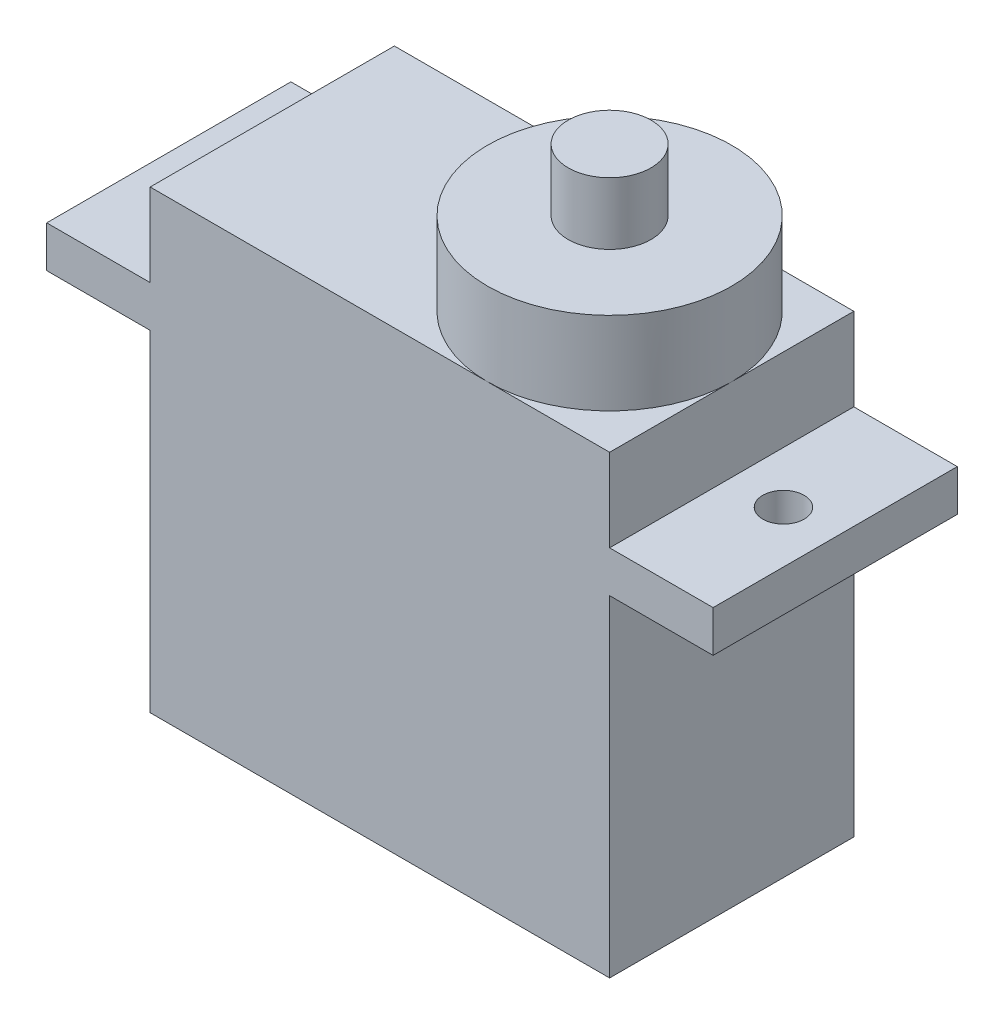
ISO-10303-21;
HEADER;
FILE_DESCRIPTION(('STEP AP214'),'2;1');
FILE_NAME('part.step','',(''),(''),'','','');
FILE_SCHEMA(('AUTOMOTIVE_DESIGN { 1 0 10303 214 1 1 1 1 }'));
ENDSEC;
DATA;
#1=APPLICATION_CONTEXT('core data for automotive mechanical design processes');
#2=APPLICATION_PROTOCOL_DEFINITION('international standard','automotive_design',2000,#1);
#3=PRODUCT_CONTEXT('',#1,'mechanical');
#4=PRODUCT('Part','Part','',(#3));
#5=PRODUCT_RELATED_PRODUCT_CATEGORY('part','',(#4));
#6=PRODUCT_DEFINITION_FORMATION('','',#4);
#7=PRODUCT_DEFINITION_CONTEXT('part definition',#1,'design');
#8=PRODUCT_DEFINITION('design','',#6,#7);
#9=PRODUCT_DEFINITION_SHAPE('','',#8);
#10=(LENGTH_UNIT() NAMED_UNIT(*) SI_UNIT(.MILLI.,.METRE.));
#11=(NAMED_UNIT(*) PLANE_ANGLE_UNIT() SI_UNIT($,.RADIAN.));
#12=(NAMED_UNIT(*) SI_UNIT($,.STERADIAN.) SOLID_ANGLE_UNIT());
#13=UNCERTAINTY_MEASURE_WITH_UNIT(LENGTH_MEASURE(1.E-05),#10,'distance_accuracy_value','');
#14=(GEOMETRIC_REPRESENTATION_CONTEXT(3) GLOBAL_UNCERTAINTY_ASSIGNED_CONTEXT((#13)) GLOBAL_UNIT_ASSIGNED_CONTEXT((#10,
#11,#12)) REPRESENTATION_CONTEXT('',''));
#15=CARTESIAN_POINT('',(0.,0.,0.));
#16=DIRECTION('',(0.,0.,1.));
#17=DIRECTION('',(1.,0.,0.));
#18=AXIS2_PLACEMENT_3D('',#15,#16,#17);
#19=CARTESIAN_POINT('',(-17.9964599489545,16.,11.8));
#20=DIRECTION('',(-1.,0.,0.));
#21=DIRECTION('',(0.,0.,1.));
#22=AXIS2_PLACEMENT_3D('',#19,#20,#21);
#23=PLANE('',#22);
#24=DIRECTION('',(0.,0.,-1.));
#25=VECTOR('',#24,1.);
#26=CARTESIAN_POINT('',(-17.9964599489545,0.,11.8));
#27=LINE('',#26,#25);
#28=CARTESIAN_POINT('',(-17.9964599489545,0.,11.8));
#29=VERTEX_POINT('',#28);
#30=CARTESIAN_POINT('',(-17.9964599489545,0.,0.));
#31=VERTEX_POINT('',#30);
#32=EDGE_CURVE('E241',#29,#31,#27,.T.);
#33=ORIENTED_EDGE('',*,*,#32,.T.);
#34=DIRECTION('',(0.,1.,0.));
#35=VECTOR('',#34,1.);
#36=CARTESIAN_POINT('',(-17.9964599489545,16.,0.));
#37=LINE('',#36,#35);
#38=CARTESIAN_POINT('',(-17.9964599489545,16.,0.));
#39=VERTEX_POINT('',#38);
#40=EDGE_CURVE('E204',#31,#39,#37,.T.);
#41=ORIENTED_EDGE('',*,*,#40,.T.);
#42=DIRECTION('',(0.,0.,-1.));
#43=VECTOR('',#42,1.);
#44=CARTESIAN_POINT('',(-17.9964599489545,16.,11.8));
#45=LINE('',#44,#43);
#46=CARTESIAN_POINT('',(-17.9964599489545,16.,11.8));
#47=VERTEX_POINT('',#46);
#48=EDGE_CURVE('E238',#47,#39,#45,.T.);
#49=ORIENTED_EDGE('',*,*,#48,.F.);
#50=DIRECTION('',(0.,1.,0.));
#51=VECTOR('',#50,1.);
#52=CARTESIAN_POINT('',(-17.9964599489545,16.,11.8));
#53=LINE('',#52,#51);
#54=EDGE_CURVE('E182',#29,#47,#53,.T.);
#55=ORIENTED_EDGE('',*,*,#54,.F.);
#56=EDGE_LOOP('',(#33,#41,#49,#55));
#57=FACE_BOUND('',#56,.T.);
#58=ADVANCED_FACE('F32',(#57),#23,.F.);
#59=CARTESIAN_POINT('',(-23.8964599489545,26.,5.9));
#60=DIRECTION('',(0.,1.,0.));
#61=DIRECTION('',(0.,0.,1.));
#62=AXIS2_PLACEMENT_3D('',#59,#60,#61);
#63=PLANE('',#62);
#64=CARTESIAN_POINT('',(-23.8964599489545,26.,5.9));
#65=DIRECTION('',(0.,1.,0.));
#66=DIRECTION('',(0.,0.,1.));
#67=AXIS2_PLACEMENT_3D('',#64,#65,#66);
#68=CIRCLE('',#67,5.9);
#69=CARTESIAN_POINT('',(-23.8964599489545,26.,11.8));
#70=VERTEX_POINT('',#69);
#71=EDGE_CURVE('E152',#70,#70,#68,.T.);
#72=ORIENTED_EDGE('',*,*,#71,.T.);
#73=EDGE_LOOP('',(#72));
#74=FACE_BOUND('',#73,.T.);
#75=CARTESIAN_POINT('',(-23.8964599489545,26.,5.9));
#76=DIRECTION('',(0.,1.,0.));
#77=DIRECTION('',(0.,0.,1.));
#78=AXIS2_PLACEMENT_3D('',#75,#76,#77);
#79=CIRCLE('',#78,2.);
#80=CARTESIAN_POINT('',(-23.8964599489545,26.,7.9));
#81=VERTEX_POINT('',#80);
#82=EDGE_CURVE('E495',#81,#81,#79,.T.);
#83=ORIENTED_EDGE('',*,*,#82,.F.);
#84=EDGE_LOOP('',(#83));
#85=FACE_BOUND('',#84,.T.);
#86=ADVANCED_FACE('F292',(#74,#85),#63,.T.);
#87=CARTESIAN_POINT('',(-40.1964599489545,22.,11.8));
#88=DIRECTION('',(0.,-1.,0.));
#89=DIRECTION('',(0.,0.,-1.));
#90=AXIS2_PLACEMENT_3D('',#87,#88,#89);
#91=PLANE('',#90);
#92=CARTESIAN_POINT('',(-23.8964599489545,22.,5.9));
#93=DIRECTION('',(0.,1.,0.));
#94=DIRECTION('',(0.,0.,1.));
#95=AXIS2_PLACEMENT_3D('',#92,#93,#94);
#96=CIRCLE('',#95,5.9);
#97=CARTESIAN_POINT('',(-23.8964599489545,22.,11.8));
#98=VERTEX_POINT('',#97);
#99=CARTESIAN_POINT('',(-17.9964599489545,22.,5.9));
#100=VERTEX_POINT('',#99);
#101=EDGE_CURVE('E43',#98,#100,#96,.T.);
#102=ORIENTED_EDGE('',*,*,#101,.F.);
#103=DIRECTION('',(-1.,0.,0.));
#104=VECTOR('',#103,1.);
#105=CARTESIAN_POINT('',(-40.1964599489545,22.,11.8));
#106=LINE('',#105,#104);
#107=CARTESIAN_POINT('',(-17.9964599489545,22.,11.8));
#108=VERTEX_POINT('',#107);
#109=EDGE_CURVE('E131',#108,#98,#106,.T.);
#110=ORIENTED_EDGE('',*,*,#109,.F.);
#111=DIRECTION('',(0.,0.,-1.));
#112=VECTOR('',#111,1.);
#113=CARTESIAN_POINT('',(-17.9964599489545,22.,11.8));
#114=LINE('',#113,#112);
#115=EDGE_CURVE('E150',#108,#100,#114,.T.);
#116=ORIENTED_EDGE('',*,*,#115,.T.);
#117=EDGE_LOOP('',(#102,#110,#116));
#118=FACE_BOUND('',#117,.T.);
#119=ADVANCED_FACE('F149',(#118),#91,.F.);
#120=CARTESIAN_POINT('',(-23.8964599489545,22.,0.));
#121=VERTEX_POINT('',#120);
#122=EDGE_CURVE('E11',#100,#121,#96,.T.);
#123=ORIENTED_EDGE('',*,*,#122,.F.);
#124=CARTESIAN_POINT('',(-17.9964599489545,22.,0.));
#125=VERTEX_POINT('',#124);
#126=EDGE_CURVE('E227',#100,#125,#114,.T.);
#127=ORIENTED_EDGE('',*,*,#126,.T.);
#128=DIRECTION('',(-1.,0.,0.));
#129=VECTOR('',#128,1.);
#130=CARTESIAN_POINT('',(-40.1964599489545,22.,0.));
#131=LINE('',#130,#129);
#132=EDGE_CURVE('E216',#125,#121,#131,.T.);
#133=ORIENTED_EDGE('',*,*,#132,.T.);
#134=EDGE_LOOP('',(#123,#127,#133));
#135=FACE_BOUND('',#134,.T.);
#136=ADVANCED_FACE('F424',(#135),#91,.F.);
#137=EDGE_CURVE('E41',#121,#98,#96,.T.);
#138=ORIENTED_EDGE('',*,*,#137,.F.);
#139=CARTESIAN_POINT('',(-40.1964599489545,22.,0.));
#140=VERTEX_POINT('',#139);
#141=EDGE_CURVE('E215',#121,#140,#131,.T.);
#142=ORIENTED_EDGE('',*,*,#141,.T.);
#143=DIRECTION('',(0.,0.,-1.));
#144=VECTOR('',#143,1.);
#145=CARTESIAN_POINT('',(-40.1964599489545,22.,11.8));
#146=LINE('',#145,#144);
#147=CARTESIAN_POINT('',(-40.1964599489545,22.,11.8));
#148=VERTEX_POINT('',#147);
#149=EDGE_CURVE('E146',#148,#140,#146,.T.);
#150=ORIENTED_EDGE('',*,*,#149,.F.);
#151=EDGE_CURVE('E134',#98,#148,#106,.T.);
#152=ORIENTED_EDGE('',*,*,#151,.F.);
#153=EDGE_LOOP('',(#138,#142,#150,#152));
#154=FACE_BOUND('',#153,.T.);
#155=ADVANCED_FACE('F144',(#154),#91,.F.);
#156=CARTESIAN_POINT('',(-45.1964599489545,16.,11.8));
#157=DIRECTION('',(1.,0.,0.));
#158=DIRECTION('',(0.,0.,-1.));
#159=AXIS2_PLACEMENT_3D('',#156,#157,#158);
#160=PLANE('',#159);
#161=DIRECTION('',(0.,-1.,0.));
#162=VECTOR('',#161,1.);
#163=CARTESIAN_POINT('',(-45.1964599489545,16.,0.));
#164=LINE('',#163,#162);
#165=CARTESIAN_POINT('',(-45.1964599489545,18.,0.));
#166=VERTEX_POINT('',#165);
#167=CARTESIAN_POINT('',(-45.1964599489545,16.,0.));
#168=VERTEX_POINT('',#167);
#169=EDGE_CURVE('E172',#166,#168,#164,.T.);
#170=ORIENTED_EDGE('',*,*,#169,.T.);
#171=DIRECTION('',(0.,0.,-1.));
#172=VECTOR('',#171,1.);
#173=CARTESIAN_POINT('',(-45.1964599489545,16.,11.8));
#174=LINE('',#173,#172);
#175=CARTESIAN_POINT('',(-45.1964599489545,16.,11.8));
#176=VERTEX_POINT('',#175);
#177=EDGE_CURVE('E36',#176,#168,#174,.T.);
#178=ORIENTED_EDGE('',*,*,#177,.F.);
#179=DIRECTION('',(0.,-1.,0.));
#180=VECTOR('',#179,1.);
#181=CARTESIAN_POINT('',(-45.1964599489545,16.,11.8));
#182=LINE('',#181,#180);
#183=CARTESIAN_POINT('',(-45.1964599489545,18.,11.8));
#184=VERTEX_POINT('',#183);
#185=EDGE_CURVE('E173',#184,#176,#182,.T.);
#186=ORIENTED_EDGE('',*,*,#185,.F.);
#187=DIRECTION('',(0.,0.,-1.));
#188=VECTOR('',#187,1.);
#189=CARTESIAN_POINT('',(-45.1964599489545,18.,11.8));
#190=LINE('',#189,#188);
#191=EDGE_CURVE('E194',#184,#166,#190,.T.);
#192=ORIENTED_EDGE('',*,*,#191,.T.);
#193=EDGE_LOOP('',(#170,#178,#186,#192));
#194=FACE_BOUND('',#193,.T.);
#195=ADVANCED_FACE('F34',(#194),#160,.F.);
#196=CARTESIAN_POINT('',(-40.1964599489545,16.,11.8));
#197=DIRECTION('',(0.,1.,0.));
#198=DIRECTION('',(-1.,0.,0.));
#199=AXIS2_PLACEMENT_3D('',#196,#197,#198);
#200=PLANE('',#199);
#201=CARTESIAN_POINT('',(-42.6964599489545,16.,5.9));
#202=DIRECTION('',(0.,1.,0.));
#203=DIRECTION('',(-1.,0.,0.));
#204=AXIS2_PLACEMENT_3D('',#201,#202,#203);
#205=CIRCLE('',#204,0.999999999999998);
#206=CARTESIAN_POINT('',(-43.6964599489545,16.,5.9));
#207=VERTEX_POINT('',#206);
#208=EDGE_CURVE('E169',#207,#207,#205,.T.);
#209=ORIENTED_EDGE('',*,*,#208,.T.);
#210=EDGE_LOOP('',(#209));
#211=FACE_BOUND('',#210,.T.);
#212=DIRECTION('',(1.,0.,0.));
#213=VECTOR('',#212,1.);
#214=CARTESIAN_POINT('',(-40.1964599489545,16.,0.));
#215=LINE('',#214,#213);
#216=CARTESIAN_POINT('',(-40.1964599489545,16.,0.));
#217=VERTEX_POINT('',#216);
#218=EDGE_CURVE('E197',#168,#217,#215,.T.);
#219=ORIENTED_EDGE('',*,*,#218,.T.);
#220=DIRECTION('',(0.,0.,-1.));
#221=VECTOR('',#220,1.);
#222=CARTESIAN_POINT('',(-40.1964599489545,16.,11.8));
#223=LINE('',#222,#221);
#224=CARTESIAN_POINT('',(-40.1964599489545,16.,11.8));
#225=VERTEX_POINT('',#224);
#226=EDGE_CURVE('E156',#225,#217,#223,.T.);
#227=ORIENTED_EDGE('',*,*,#226,.F.);
#228=DIRECTION('',(1.,0.,0.));
#229=VECTOR('',#228,1.);
#230=CARTESIAN_POINT('',(-40.1964599489545,16.,11.8));
#231=LINE('',#230,#229);
#232=EDGE_CURVE('E175',#176,#225,#231,.T.);
#233=ORIENTED_EDGE('',*,*,#232,.F.);
#234=ORIENTED_EDGE('',*,*,#177,.T.);
#235=EDGE_LOOP('',(#219,#227,#233,#234));
#236=FACE_BOUND('',#235,.T.);
#237=ADVANCED_FACE('F267',(#211,#236),#200,.F.);
#238=CARTESIAN_POINT('',(-40.1964599489545,0.,11.8));
#239=DIRECTION('',(1.,0.,0.));
#240=DIRECTION('',(0.,0.,-1.));
#241=AXIS2_PLACEMENT_3D('',#238,#239,#240);
#242=PLANE('',#241);
#243=DIRECTION('',(0.,-1.,0.));
#244=VECTOR('',#243,1.);
#245=CARTESIAN_POINT('',(-40.1964599489545,0.,0.));
#246=LINE('',#245,#244);
#247=CARTESIAN_POINT('',(-40.1964599489545,0.,0.));
#248=VERTEX_POINT('',#247);
#249=EDGE_CURVE('E199',#217,#248,#246,.T.);
#250=ORIENTED_EDGE('',*,*,#249,.T.);
#251=DIRECTION('',(0.,0.,-1.));
#252=VECTOR('',#251,1.);
#253=CARTESIAN_POINT('',(-40.1964599489545,0.,11.8));
#254=LINE('',#253,#252);
#255=CARTESIAN_POINT('',(-40.1964599489545,0.,11.8));
#256=VERTEX_POINT('',#255);
#257=EDGE_CURVE('E243',#256,#248,#254,.T.);
#258=ORIENTED_EDGE('',*,*,#257,.F.);
#259=DIRECTION('',(0.,-1.,0.));
#260=VECTOR('',#259,1.);
#261=CARTESIAN_POINT('',(-40.1964599489545,0.,11.8));
#262=LINE('',#261,#260);
#263=EDGE_CURVE('E178',#225,#256,#262,.T.);
#264=ORIENTED_EDGE('',*,*,#263,.F.);
#265=ORIENTED_EDGE('',*,*,#226,.T.);
#266=EDGE_LOOP('',(#250,#258,#264,#265));
#267=FACE_BOUND('',#266,.T.);
#268=ADVANCED_FACE('F250',(#267),#242,.F.);
#269=CARTESIAN_POINT('',(-17.9964599489545,0.,11.8));
#270=DIRECTION('',(0.,1.,0.));
#271=DIRECTION('',(-1.,0.,0.));
#272=AXIS2_PLACEMENT_3D('',#269,#270,#271);
#273=PLANE('',#272);
#274=DIRECTION('',(1.,0.,0.));
#275=VECTOR('',#274,1.);
#276=CARTESIAN_POINT('',(-17.9964599489545,0.,0.));
#277=LINE('',#276,#275);
#278=EDGE_CURVE('E201',#248,#31,#277,.T.);
#279=ORIENTED_EDGE('',*,*,#278,.T.);
#280=ORIENTED_EDGE('',*,*,#32,.F.);
#281=DIRECTION('',(1.,0.,0.));
#282=VECTOR('',#281,1.);
#283=CARTESIAN_POINT('',(-17.9964599489545,0.,11.8));
#284=LINE('',#283,#282);
#285=EDGE_CURVE('E180',#256,#29,#284,.T.);
#286=ORIENTED_EDGE('',*,*,#285,.F.);
#287=ORIENTED_EDGE('',*,*,#257,.T.);
#288=EDGE_LOOP('',(#279,#280,#286,#287));
#289=FACE_BOUND('',#288,.T.);
#290=ADVANCED_FACE('F261',(#289),#273,.F.);
#291=CARTESIAN_POINT('',(-12.9964599489545,16.,11.8));
#292=DIRECTION('',(0.,1.,0.));
#293=DIRECTION('',(0.,0.,1.));
#294=AXIS2_PLACEMENT_3D('',#291,#292,#293);
#295=PLANE('',#294);
#296=CARTESIAN_POINT('',(-15.4964599489545,16.,5.9));
#297=DIRECTION('',(0.,1.,0.));
#298=DIRECTION('',(0.,0.,1.));
#299=AXIS2_PLACEMENT_3D('',#296,#297,#298);
#300=CIRCLE('',#299,1.);
#301=CARTESIAN_POINT('',(-15.4964599489545,16.,6.9));
#302=VERTEX_POINT('',#301);
#303=EDGE_CURVE('E163',#302,#302,#300,.T.);
#304=ORIENTED_EDGE('',*,*,#303,.T.);
#305=EDGE_LOOP('',(#304));
#306=FACE_BOUND('',#305,.T.);
#307=DIRECTION('',(1.,0.,0.));
#308=VECTOR('',#307,1.);
#309=CARTESIAN_POINT('',(-12.9964599489545,16.,0.));
#310=LINE('',#309,#308);
#311=CARTESIAN_POINT('',(-12.9964599489545,16.,0.));
#312=VERTEX_POINT('',#311);
#313=EDGE_CURVE('E206',#39,#312,#310,.T.);
#314=ORIENTED_EDGE('',*,*,#313,.T.);
#315=DIRECTION('',(0.,0.,-1.));
#316=VECTOR('',#315,1.);
#317=CARTESIAN_POINT('',(-12.9964599489545,16.,11.8));
#318=LINE('',#317,#316);
#319=CARTESIAN_POINT('',(-12.9964599489545,16.,11.8));
#320=VERTEX_POINT('',#319);
#321=EDGE_CURVE('E235',#320,#312,#318,.T.);
#322=ORIENTED_EDGE('',*,*,#321,.F.);
#323=DIRECTION('',(1.,0.,0.));
#324=VECTOR('',#323,1.);
#325=CARTESIAN_POINT('',(-12.9964599489545,16.,11.8));
#326=LINE('',#325,#324);
#327=EDGE_CURVE('E184',#47,#320,#326,.T.);
#328=ORIENTED_EDGE('',*,*,#327,.F.);
#329=ORIENTED_EDGE('',*,*,#48,.T.);
#330=EDGE_LOOP('',(#314,#322,#328,#329));
#331=FACE_BOUND('',#330,.T.);
#332=ADVANCED_FACE('F302',(#306,#331),#295,.F.);
#333=CARTESIAN_POINT('',(-12.9964599489545,18.,11.8));
#334=DIRECTION('',(-1.,0.,0.));
#335=DIRECTION('',(0.,0.,1.));
#336=AXIS2_PLACEMENT_3D('',#333,#334,#335);
#337=PLANE('',#336);
#338=DIRECTION('',(0.,1.,0.));
#339=VECTOR('',#338,1.);
#340=CARTESIAN_POINT('',(-12.9964599489545,18.,0.));
#341=LINE('',#340,#339);
#342=CARTESIAN_POINT('',(-12.9964599489545,18.,0.));
#343=VERTEX_POINT('',#342);
#344=EDGE_CURVE('E208',#312,#343,#341,.T.);
#345=ORIENTED_EDGE('',*,*,#344,.T.);
#346=DIRECTION('',(0.,0.,-1.));
#347=VECTOR('',#346,1.);
#348=CARTESIAN_POINT('',(-12.9964599489545,18.,11.8));
#349=LINE('',#348,#347);
#350=CARTESIAN_POINT('',(-12.9964599489545,18.,11.8));
#351=VERTEX_POINT('',#350);
#352=EDGE_CURVE('E232',#351,#343,#349,.T.);
#353=ORIENTED_EDGE('',*,*,#352,.F.);
#354=DIRECTION('',(0.,1.,0.));
#355=VECTOR('',#354,1.);
#356=CARTESIAN_POINT('',(-12.9964599489545,18.,11.8));
#357=LINE('',#356,#355);
#358=EDGE_CURVE('E186',#320,#351,#357,.T.);
#359=ORIENTED_EDGE('',*,*,#358,.F.);
#360=ORIENTED_EDGE('',*,*,#321,.T.);
#361=EDGE_LOOP('',(#345,#353,#359,#360));
#362=FACE_BOUND('',#361,.T.);
#363=ADVANCED_FACE('F398',(#362),#337,.F.);
#364=CARTESIAN_POINT('',(-17.9964599489545,18.,11.8));
#365=DIRECTION('',(0.,-1.,0.));
#366=DIRECTION('',(0.,0.,-1.));
#367=AXIS2_PLACEMENT_3D('',#364,#365,#366);
#368=PLANE('',#367);
#369=CARTESIAN_POINT('',(-15.4964599489545,18.,5.9));
#370=DIRECTION('',(0.,1.,0.));
#371=DIRECTION('',(0.,0.,1.));
#372=AXIS2_PLACEMENT_3D('',#369,#370,#371);
#373=CIRCLE('',#372,1.);
#374=CARTESIAN_POINT('',(-15.4964599489545,18.,6.9));
#375=VERTEX_POINT('',#374);
#376=EDGE_CURVE('E160',#375,#375,#373,.T.);
#377=ORIENTED_EDGE('',*,*,#376,.F.);
#378=EDGE_LOOP('',(#377));
#379=FACE_BOUND('',#378,.T.);
#380=DIRECTION('',(-1.,0.,0.));
#381=VECTOR('',#380,1.);
#382=CARTESIAN_POINT('',(-17.9964599489545,18.,0.));
#383=LINE('',#382,#381);
#384=CARTESIAN_POINT('',(-17.9964599489545,18.,0.));
#385=VERTEX_POINT('',#384);
#386=EDGE_CURVE('E210',#343,#385,#383,.T.);
#387=ORIENTED_EDGE('',*,*,#386,.T.);
#388=DIRECTION('',(0.,0.,-1.));
#389=VECTOR('',#388,1.);
#390=CARTESIAN_POINT('',(-17.9964599489545,18.,11.8));
#391=LINE('',#390,#389);
#392=CARTESIAN_POINT('',(-17.9964599489545,18.,11.8));
#393=VERTEX_POINT('',#392);
#394=EDGE_CURVE('E229',#393,#385,#391,.T.);
#395=ORIENTED_EDGE('',*,*,#394,.F.);
#396=DIRECTION('',(-1.,0.,0.));
#397=VECTOR('',#396,1.);
#398=CARTESIAN_POINT('',(-17.9964599489545,18.,11.8));
#399=LINE('',#398,#397);
#400=EDGE_CURVE('E188',#351,#393,#399,.T.);
#401=ORIENTED_EDGE('',*,*,#400,.F.);
#402=ORIENTED_EDGE('',*,*,#352,.T.);
#403=EDGE_LOOP('',(#387,#395,#401,#402));
#404=FACE_BOUND('',#403,.T.);
#405=ADVANCED_FACE('F287',(#379,#404),#368,.F.);
#406=CARTESIAN_POINT('',(-17.9964599489545,22.,11.8));
#407=DIRECTION('',(-1.,0.,0.));
#408=DIRECTION('',(0.,-1.,0.));
#409=AXIS2_PLACEMENT_3D('',#406,#407,#408);
#410=PLANE('',#409);
#411=DIRECTION('',(0.,1.,0.));
#412=VECTOR('',#411,1.);
#413=CARTESIAN_POINT('',(-17.9964599489545,22.,0.));
#414=LINE('',#413,#412);
#415=EDGE_CURVE('E212',#385,#125,#414,.T.);
#416=ORIENTED_EDGE('',*,*,#415,.T.);
#417=ORIENTED_EDGE('',*,*,#126,.F.);
#418=ORIENTED_EDGE('',*,*,#115,.F.);
#419=DIRECTION('',(0.,1.,0.));
#420=VECTOR('',#419,1.);
#421=CARTESIAN_POINT('',(-17.9964599489545,22.,11.8));
#422=LINE('',#421,#420);
#423=EDGE_CURVE('E137',#393,#108,#422,.T.);
#424=ORIENTED_EDGE('',*,*,#423,.F.);
#425=ORIENTED_EDGE('',*,*,#394,.T.);
#426=EDGE_LOOP('',(#416,#417,#418,#424,#425));
#427=FACE_BOUND('',#426,.T.);
#428=ADVANCED_FACE('F279',(#427),#410,.F.);
#429=CARTESIAN_POINT('',(-40.1964599489545,18.,11.8));
#430=DIRECTION('',(1.,0.,0.));
#431=DIRECTION('',(0.,0.,-1.));
#432=AXIS2_PLACEMENT_3D('',#429,#430,#431);
#433=PLANE('',#432);
#434=DIRECTION('',(0.,-1.,0.));
#435=VECTOR('',#434,1.);
#436=CARTESIAN_POINT('',(-40.1964599489545,18.,0.));
#437=LINE('',#436,#435);
#438=CARTESIAN_POINT('',(-40.1964599489545,18.,0.));
#439=VERTEX_POINT('',#438);
#440=EDGE_CURVE('E218',#140,#439,#437,.T.);
#441=ORIENTED_EDGE('',*,*,#440,.T.);
#442=DIRECTION('',(0.,0.,-1.));
#443=VECTOR('',#442,1.);
#444=CARTESIAN_POINT('',(-40.1964599489545,18.,11.8));
#445=LINE('',#444,#443);
#446=CARTESIAN_POINT('',(-40.1964599489545,18.,11.8));
#447=VERTEX_POINT('',#446);
#448=EDGE_CURVE('E223',#447,#439,#445,.T.);
#449=ORIENTED_EDGE('',*,*,#448,.F.);
#450=DIRECTION('',(0.,-1.,0.));
#451=VECTOR('',#450,1.);
#452=CARTESIAN_POINT('',(-40.1964599489545,18.,11.8));
#453=LINE('',#452,#451);
#454=EDGE_CURVE('E142',#148,#447,#453,.T.);
#455=ORIENTED_EDGE('',*,*,#454,.F.);
#456=ORIENTED_EDGE('',*,*,#149,.T.);
#457=EDGE_LOOP('',(#441,#449,#455,#456));
#458=FACE_BOUND('',#457,.T.);
#459=ADVANCED_FACE('F277',(#458),#433,.F.);
#460=CARTESIAN_POINT('',(-45.1964599489545,18.,11.8));
#461=DIRECTION('',(0.,-1.,0.));
#462=DIRECTION('',(0.,0.,-1.));
#463=AXIS2_PLACEMENT_3D('',#460,#461,#462);
#464=PLANE('',#463);
#465=CARTESIAN_POINT('',(-42.6964599489545,18.,5.9));
#466=DIRECTION('',(0.,1.,0.));
#467=DIRECTION('',(0.,0.,1.));
#468=AXIS2_PLACEMENT_3D('',#465,#466,#467);
#469=CIRCLE('',#468,0.999999999999998);
#470=CARTESIAN_POINT('',(-42.6964599489545,18.,6.9));
#471=VERTEX_POINT('',#470);
#472=EDGE_CURVE('E166',#471,#471,#469,.T.);
#473=ORIENTED_EDGE('',*,*,#472,.F.);
#474=EDGE_LOOP('',(#473));
#475=FACE_BOUND('',#474,.T.);
#476=DIRECTION('',(-1.,0.,0.));
#477=VECTOR('',#476,1.);
#478=CARTESIAN_POINT('',(-45.1964599489545,18.,0.));
#479=LINE('',#478,#477);
#480=EDGE_CURVE('E176',#439,#166,#479,.T.);
#481=ORIENTED_EDGE('',*,*,#480,.T.);
#482=ORIENTED_EDGE('',*,*,#191,.F.);
#483=DIRECTION('',(-1.,0.,0.));
#484=VECTOR('',#483,1.);
#485=CARTESIAN_POINT('',(-45.1964599489545,18.,11.8));
#486=LINE('',#485,#484);
#487=EDGE_CURVE('E192',#447,#184,#486,.T.);
#488=ORIENTED_EDGE('',*,*,#487,.F.);
#489=ORIENTED_EDGE('',*,*,#448,.T.);
#490=EDGE_LOOP('',(#481,#482,#488,#489));
#491=FACE_BOUND('',#490,.T.);
#492=ADVANCED_FACE('F273',(#475,#491),#464,.F.);
#493=CARTESIAN_POINT('',(0.,0.,11.8));
#494=DIRECTION('',(0.,0.,-1.));
#495=DIRECTION('',(-1.,0.,0.));
#496=AXIS2_PLACEMENT_3D('',#493,#494,#495);
#497=PLANE('',#496);
#498=ORIENTED_EDGE('',*,*,#185,.T.);
#499=ORIENTED_EDGE('',*,*,#232,.T.);
#500=ORIENTED_EDGE('',*,*,#263,.T.);
#501=ORIENTED_EDGE('',*,*,#285,.T.);
#502=ORIENTED_EDGE('',*,*,#54,.T.);
#503=ORIENTED_EDGE('',*,*,#327,.T.);
#504=ORIENTED_EDGE('',*,*,#358,.T.);
#505=ORIENTED_EDGE('',*,*,#400,.T.);
#506=ORIENTED_EDGE('',*,*,#423,.T.);
#507=ORIENTED_EDGE('',*,*,#109,.T.);
#508=ORIENTED_EDGE('',*,*,#151,.T.);
#509=ORIENTED_EDGE('',*,*,#454,.T.);
#510=ORIENTED_EDGE('',*,*,#487,.T.);
#511=EDGE_LOOP('',(#498,#499,#500,#501,#502,#503,#504,#505,#506,#507,#508,#509,#510));
#512=FACE_BOUND('',#511,.T.);
#513=ADVANCED_FACE('F133',(#512),#497,.F.);
#514=CARTESIAN_POINT('',(0.,0.,0.));
#515=DIRECTION('',(0.,0.,-1.));
#516=DIRECTION('',(-1.,0.,0.));
#517=AXIS2_PLACEMENT_3D('',#514,#515,#516);
#518=PLANE('',#517);
#519=ORIENTED_EDGE('',*,*,#169,.F.);
#520=ORIENTED_EDGE('',*,*,#480,.F.);
#521=ORIENTED_EDGE('',*,*,#440,.F.);
#522=ORIENTED_EDGE('',*,*,#141,.F.);
#523=ORIENTED_EDGE('',*,*,#132,.F.);
#524=ORIENTED_EDGE('',*,*,#415,.F.);
#525=ORIENTED_EDGE('',*,*,#386,.F.);
#526=ORIENTED_EDGE('',*,*,#344,.F.);
#527=ORIENTED_EDGE('',*,*,#313,.F.);
#528=ORIENTED_EDGE('',*,*,#40,.F.);
#529=ORIENTED_EDGE('',*,*,#278,.F.);
#530=ORIENTED_EDGE('',*,*,#249,.F.);
#531=ORIENTED_EDGE('',*,*,#218,.F.);
#532=EDGE_LOOP('',(#519,#520,#521,#522,#523,#524,#525,#526,#527,#528,#529,#530,#531));
#533=FACE_BOUND('',#532,.T.);
#534=ADVANCED_FACE('F256',(#533),#518,.T.);
#535=CARTESIAN_POINT('',(-42.6964599489545,6.2,5.9));
#536=DIRECTION('',(0.,1.,0.));
#537=DIRECTION('',(0.,0.,1.));
#538=AXIS2_PLACEMENT_3D('',#535,#536,#537);
#539=CYLINDRICAL_SURFACE('',#538,0.999999999999998);
#540=ORIENTED_EDGE('',*,*,#472,.T.);
#541=EDGE_LOOP('',(#540));
#542=FACE_BOUND('',#541,.T.);
#543=ORIENTED_EDGE('',*,*,#208,.F.);
#544=EDGE_LOOP('',(#543));
#545=FACE_BOUND('',#544,.T.);
#546=ADVANCED_FACE('F314',(#542,#545),#539,.F.);
#547=CARTESIAN_POINT('',(-15.4964599489545,6.2,5.9));
#548=DIRECTION('',(0.,1.,0.));
#549=DIRECTION('',(0.,0.,1.));
#550=AXIS2_PLACEMENT_3D('',#547,#548,#549);
#551=CYLINDRICAL_SURFACE('',#550,1.);
#552=ORIENTED_EDGE('',*,*,#376,.T.);
#553=EDGE_LOOP('',(#552));
#554=FACE_BOUND('',#553,.T.);
#555=ORIENTED_EDGE('',*,*,#303,.F.);
#556=EDGE_LOOP('',(#555));
#557=FACE_BOUND('',#556,.T.);
#558=ADVANCED_FACE('F316',(#554,#557),#551,.F.);
#559=CARTESIAN_POINT('',(-23.8964599489545,26.,5.9));
#560=DIRECTION('',(0.,-1.,0.));
#561=DIRECTION('',(0.,0.,-1.));
#562=AXIS2_PLACEMENT_3D('',#559,#560,#561);
#563=CYLINDRICAL_SURFACE('',#562,5.9);
#564=ORIENTED_EDGE('',*,*,#71,.F.);
#565=EDGE_LOOP('',(#564));
#566=FACE_BOUND('',#565,.T.);
#567=ORIENTED_EDGE('',*,*,#101,.T.);
#568=ORIENTED_EDGE('',*,*,#122,.T.);
#569=ORIENTED_EDGE('',*,*,#137,.T.);
#570=EDGE_LOOP('',(#567,#568,#569));
#571=FACE_BOUND('',#570,.T.);
#572=ADVANCED_FACE('F154',(#566,#571),#563,.T.);
#573=CARTESIAN_POINT('',(-23.8964599489545,29.,5.9));
#574=DIRECTION('',(0.,-1.,0.));
#575=DIRECTION('',(0.,0.,-1.));
#576=AXIS2_PLACEMENT_3D('',#573,#574,#575);
#577=CYLINDRICAL_SURFACE('',#576,2.);
#578=CARTESIAN_POINT('',(-23.8964599489545,29.,5.9));
#579=DIRECTION('',(0.,1.,0.));
#580=DIRECTION('',(0.,0.,1.));
#581=AXIS2_PLACEMENT_3D('',#578,#579,#580);
#582=CIRCLE('',#581,2.);
#583=CARTESIAN_POINT('',(-23.8964599489545,29.,7.9));
#584=VERTEX_POINT('',#583);
#585=EDGE_CURVE('E153',#584,#584,#582,.T.);
#586=ORIENTED_EDGE('',*,*,#585,.F.);
#587=EDGE_LOOP('',(#586));
#588=FACE_BOUND('',#587,.T.);
#589=ORIENTED_EDGE('',*,*,#82,.T.);
#590=EDGE_LOOP('',(#589));
#591=FACE_BOUND('',#590,.T.);
#592=ADVANCED_FACE('F348',(#588,#591),#577,.T.);
#593=CARTESIAN_POINT('',(-23.8964599489545,29.,5.9));
#594=DIRECTION('',(0.,1.,0.));
#595=DIRECTION('',(0.,0.,1.));
#596=AXIS2_PLACEMENT_3D('',#593,#594,#595);
#597=PLANE('',#596);
#598=ORIENTED_EDGE('',*,*,#585,.T.);
#599=EDGE_LOOP('',(#598));
#600=FACE_BOUND('',#599,.T.);
#601=ADVANCED_FACE('F365',(#600),#597,.T.);
#602=CLOSED_SHELL('',(#58,#86,#119,#136,#155,#195,#237,#268,#290,#332,#363,#405,#428,#459,#492,
#513,#534,#546,#558,#572,#592,#601));
#603=MANIFOLD_SOLID_BREP('B2',#602);
#604=ADVANCED_BREP_SHAPE_REPRESENTATION('',(#18,#603),#14);
#605=SHAPE_DEFINITION_REPRESENTATION(#9,#604);
ENDSEC;
END-ISO-10303-21;
